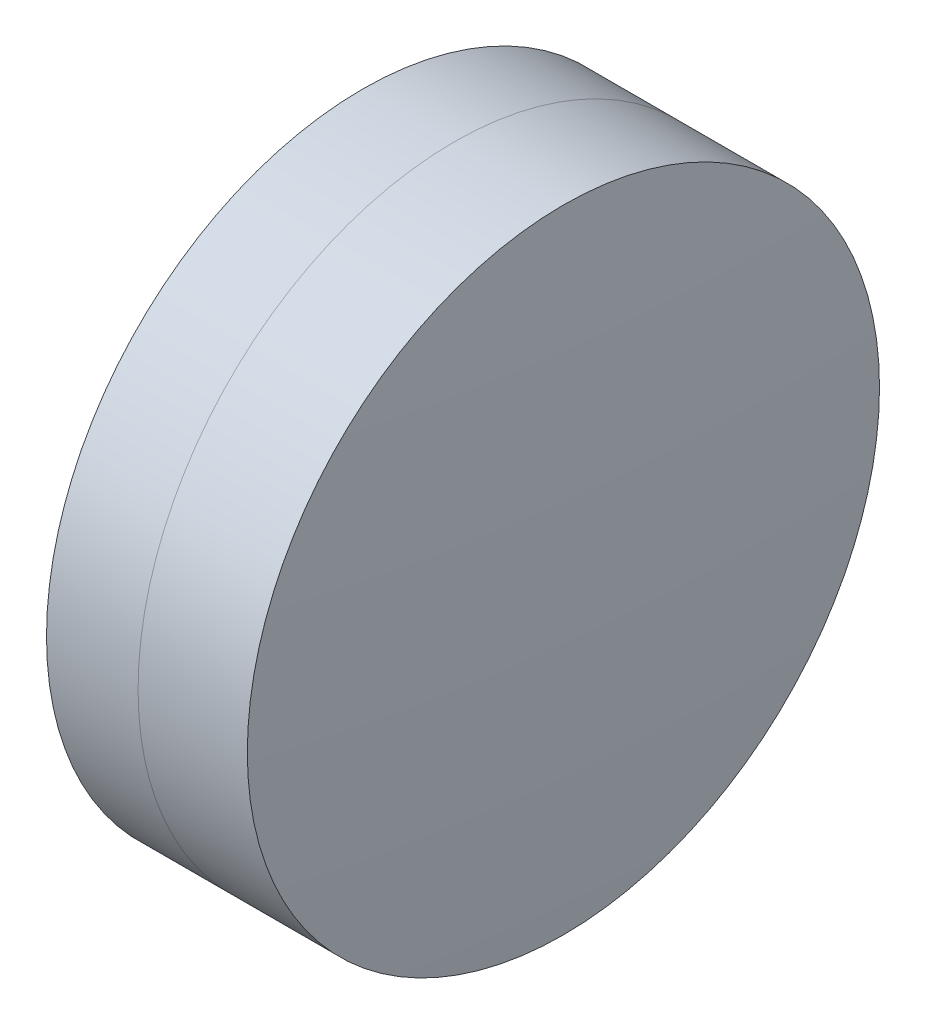
ISO-10303-21;
HEADER;
FILE_DESCRIPTION(('STEP AP214'),'2;1');
FILE_NAME('part.step','',(''),(''),'','','');
FILE_SCHEMA(('AUTOMOTIVE_DESIGN { 1 0 10303 214 1 1 1 1 }'));
ENDSEC;
DATA;
#1=APPLICATION_CONTEXT('core data for automotive mechanical design processes');
#2=APPLICATION_PROTOCOL_DEFINITION('international standard','automotive_design',2000,#1);
#3=PRODUCT_CONTEXT('',#1,'mechanical');
#4=PRODUCT('Part','Part','',(#3));
#5=PRODUCT_RELATED_PRODUCT_CATEGORY('part','',(#4));
#6=PRODUCT_DEFINITION_FORMATION('','',#4);
#7=PRODUCT_DEFINITION_CONTEXT('part definition',#1,'design');
#8=PRODUCT_DEFINITION('design','',#6,#7);
#9=PRODUCT_DEFINITION_SHAPE('','',#8);
#10=(LENGTH_UNIT() NAMED_UNIT(*) SI_UNIT(.MILLI.,.METRE.));
#11=(NAMED_UNIT(*) PLANE_ANGLE_UNIT() SI_UNIT($,.RADIAN.));
#12=(NAMED_UNIT(*) SI_UNIT($,.STERADIAN.) SOLID_ANGLE_UNIT());
#13=UNCERTAINTY_MEASURE_WITH_UNIT(LENGTH_MEASURE(1.E-05),#10,'distance_accuracy_value','');
#14=(GEOMETRIC_REPRESENTATION_CONTEXT(3) GLOBAL_UNCERTAINTY_ASSIGNED_CONTEXT((#13)) GLOBAL_UNIT_ASSIGNED_CONTEXT((#10,
#11,#12)) REPRESENTATION_CONTEXT('',''));
#15=CARTESIAN_POINT('',(0.,0.,0.));
#16=DIRECTION('',(0.,0.,1.));
#17=DIRECTION('',(1.,0.,0.));
#18=AXIS2_PLACEMENT_3D('',#15,#16,#17);
#19=CARTESIAN_POINT('',(-15.5701848228814,0.,0.));
#20=DIRECTION('',(-1.,0.,0.));
#21=DIRECTION('',(0.,0.,1.));
#22=AXIS2_PLACEMENT_3D('',#19,#20,#21);
#23=SPHERICAL_SURFACE('',#22,22.5);
#24=CARTESIAN_POINT('',(6.01516900789928,0.,0.));
#25=DIRECTION('',(-1.,0.,0.));
#26=DIRECTION('',(0.,0.,1.));
#27=AXIS2_PLACEMENT_3D('',#24,#25,#26);
#28=CIRCLE('',#27,6.35000000000001);
#29=CARTESIAN_POINT('',(6.01516900789928,0.,6.35000000000001));
#30=VERTEX_POINT('',#29);
#31=EDGE_CURVE('E11',#30,#30,#28,.T.);
#32=ORIENTED_EDGE('',*,*,#31,.T.);
#33=EDGE_LOOP('',(#32));
#34=FACE_BOUND('',#33,.T.);
#35=ADVANCED_FACE('F45',(#34),#23,.F.);
#36=CARTESIAN_POINT('',(-0.551919992657797,0.,0.));
#37=DIRECTION('',(-1.,0.,0.));
#38=DIRECTION('',(0.,0.,1.));
#39=AXIS2_PLACEMENT_3D('',#36,#37,#38);
#40=CYLINDRICAL_SURFACE('',#39,6.35);
#41=CARTESIAN_POINT('',(8.2099303768714,0.,0.));
#42=DIRECTION('',(-1.,0.,0.));
#43=DIRECTION('',(0.,0.,1.));
#44=AXIS2_PLACEMENT_3D('',#41,#42,#43);
#45=CIRCLE('',#44,6.35);
#46=CARTESIAN_POINT('',(8.2099303768714,0.,6.35));
#47=VERTEX_POINT('',#46);
#48=EDGE_CURVE('E51',#47,#47,#45,.T.);
#49=ORIENTED_EDGE('',*,*,#48,.T.);
#50=EDGE_LOOP('',(#49));
#51=FACE_BOUND('',#50,.T.);
#52=ORIENTED_EDGE('',*,*,#31,.F.);
#53=EDGE_LOOP('',(#52));
#54=FACE_BOUND('',#53,.T.);
#55=ADVANCED_FACE('F57',(#51,#54),#40,.T.);
#56=CARTESIAN_POINT('',(-83.3701848228814,0.,0.));
#57=DIRECTION('',(-1.,0.,0.));
#58=DIRECTION('',(0.,0.,1.));
#59=AXIS2_PLACEMENT_3D('',#56,#57,#58);
#60=SPHERICAL_SURFACE('',#59,91.8);
#61=ORIENTED_EDGE('',*,*,#48,.F.);
#62=EDGE_LOOP('',(#61));
#63=FACE_BOUND('',#62,.T.);
#64=ADVANCED_FACE('F60',(#63),#60,.T.);
#65=CLOSED_SHELL('',(#35,#55,#64));
#66=MANIFOLD_SOLID_BREP('B2',#65);
#67=CARTESIAN_POINT('',(30.8298151771186,0.,0.));
#68=DIRECTION('',(-1.,0.,0.));
#69=DIRECTION('',(0.,0.,-1.));
#70=AXIS2_PLACEMENT_3D('',#67,#68,#69);
#71=SPHERICAL_SURFACE('',#70,27.4);
#72=CARTESIAN_POINT('',(4.17578171124327,0.,0.));
#73=DIRECTION('',(-1.,0.,0.));
#74=DIRECTION('',(0.,0.,1.));
#75=AXIS2_PLACEMENT_3D('',#72,#73,#74);
#76=CIRCLE('',#75,6.35);
#77=CARTESIAN_POINT('',(4.17578171124327,0.,6.35));
#78=VERTEX_POINT('',#77);
#79=EDGE_CURVE('E44',#78,#78,#76,.T.);
#80=ORIENTED_EDGE('',*,*,#79,.T.);
#81=EDGE_LOOP('',(#80));
#82=FACE_BOUND('',#81,.T.);
#83=ADVANCED_FACE('F86',(#82),#71,.T.);
#84=CARTESIAN_POINT('',(-9.70261217833668,0.,0.));
#85=DIRECTION('',(-1.,0.,0.));
#86=DIRECTION('',(0.,0.,1.));
#87=AXIS2_PLACEMENT_3D('',#84,#85,#86);
#88=CYLINDRICAL_SURFACE('',#87,6.35);
#89=CARTESIAN_POINT('',(6.01516900789928,0.,0.));
#90=DIRECTION('',(-1.,0.,0.));
#91=DIRECTION('',(0.,0.,1.));
#92=AXIS2_PLACEMENT_3D('',#89,#90,#91);
#93=CIRCLE('',#92,6.35);
#94=CARTESIAN_POINT('',(6.01516900789928,0.,6.35));
#95=VERTEX_POINT('',#94);
#96=EDGE_CURVE('E92',#95,#95,#93,.T.);
#97=ORIENTED_EDGE('',*,*,#96,.T.);
#98=EDGE_LOOP('',(#97));
#99=FACE_BOUND('',#98,.T.);
#100=ORIENTED_EDGE('',*,*,#79,.F.);
#101=EDGE_LOOP('',(#100));
#102=FACE_BOUND('',#101,.T.);
#103=ADVANCED_FACE('F98',(#99,#102),#88,.T.);
#104=CARTESIAN_POINT('',(-15.5701848228814,0.,0.));
#105=DIRECTION('',(-1.,0.,0.));
#106=DIRECTION('',(0.,0.,1.));
#107=AXIS2_PLACEMENT_3D('',#104,#105,#106);
#108=SPHERICAL_SURFACE('',#107,22.5);
#109=ORIENTED_EDGE('',*,*,#96,.F.);
#110=EDGE_LOOP('',(#109));
#111=FACE_BOUND('',#110,.T.);
#112=ADVANCED_FACE('F101',(#111),#108,.T.);
#113=CLOSED_SHELL('',(#83,#103,#112));
#114=MANIFOLD_SOLID_BREP('B6',#113);
#115=ADVANCED_BREP_SHAPE_REPRESENTATION('',(#18,#66,#114),#14);
#116=SHAPE_DEFINITION_REPRESENTATION(#9,#115);
ENDSEC;
END-ISO-10303-21;
